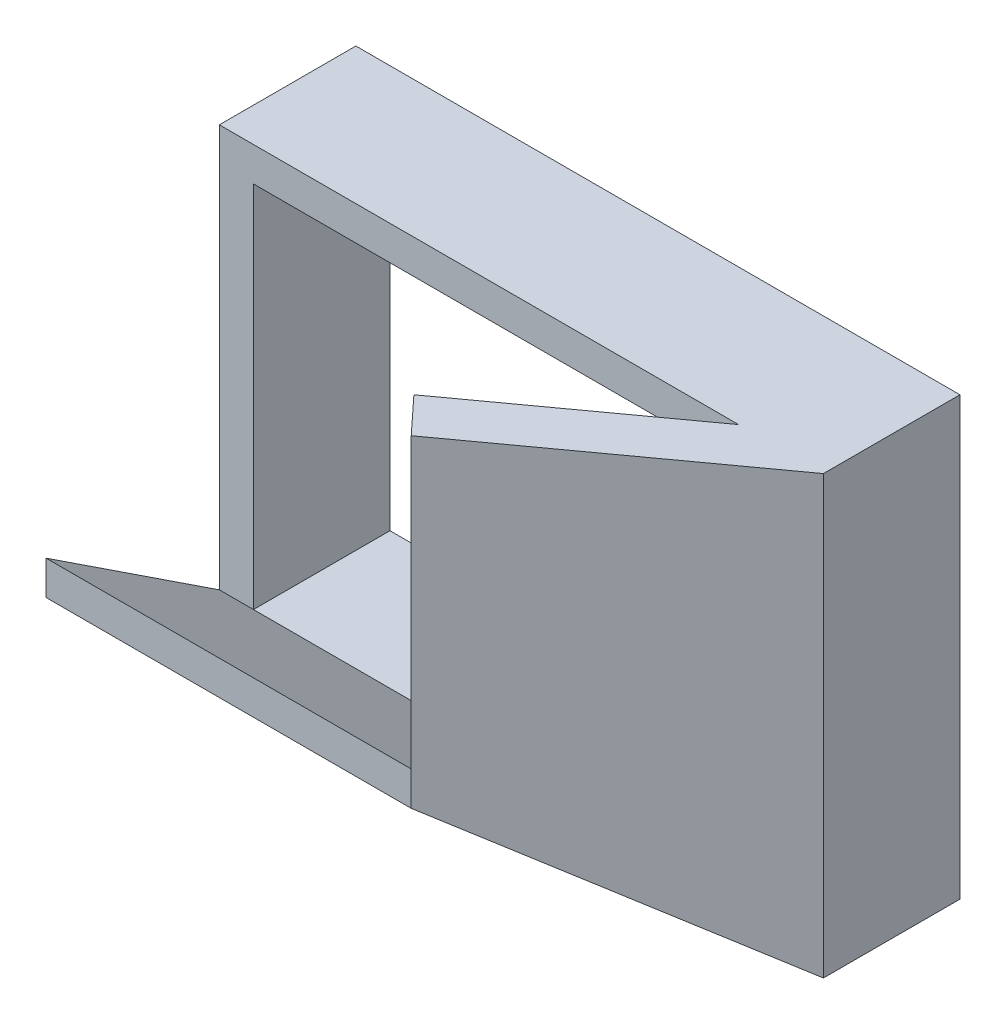
ISO-10303-21;
HEADER;
FILE_DESCRIPTION(('STEP AP214'),'2;1');
FILE_NAME('part.step','',(''),(''),'','','');
FILE_SCHEMA(('AUTOMOTIVE_DESIGN { 1 0 10303 214 1 1 1 1 }'));
ENDSEC;
DATA;
#1=APPLICATION_CONTEXT('core data for automotive mechanical design processes');
#2=APPLICATION_PROTOCOL_DEFINITION('international standard','automotive_design',2000,#1);
#3=PRODUCT_CONTEXT('',#1,'mechanical');
#4=PRODUCT('Part','Part','',(#3));
#5=PRODUCT_RELATED_PRODUCT_CATEGORY('part','',(#4));
#6=PRODUCT_DEFINITION_FORMATION('','',#4);
#7=PRODUCT_DEFINITION_CONTEXT('part definition',#1,'design');
#8=PRODUCT_DEFINITION('design','',#6,#7);
#9=PRODUCT_DEFINITION_SHAPE('','',#8);
#10=(LENGTH_UNIT() NAMED_UNIT(*) SI_UNIT(.MILLI.,.METRE.));
#11=(NAMED_UNIT(*) PLANE_ANGLE_UNIT() SI_UNIT($,.RADIAN.));
#12=(NAMED_UNIT(*) SI_UNIT($,.STERADIAN.) SOLID_ANGLE_UNIT());
#13=UNCERTAINTY_MEASURE_WITH_UNIT(LENGTH_MEASURE(1.E-05),#10,'distance_accuracy_value','');
#14=(GEOMETRIC_REPRESENTATION_CONTEXT(3) GLOBAL_UNCERTAINTY_ASSIGNED_CONTEXT((#13)) GLOBAL_UNIT_ASSIGNED_CONTEXT((#10,
#11,#12)) REPRESENTATION_CONTEXT('',''));
#15=CARTESIAN_POINT('',(0.,0.,0.));
#16=DIRECTION('',(0.,0.,1.));
#17=DIRECTION('',(1.,0.,0.));
#18=AXIS2_PLACEMENT_3D('',#15,#16,#17);
#19=CARTESIAN_POINT('',(-8.7,0.,-4.));
#20=DIRECTION('',(-1.,0.,0.));
#21=DIRECTION('',(0.,-1.,0.));
#22=AXIS2_PLACEMENT_3D('',#19,#20,#21);
#23=PLANE('',#22);
#24=DIRECTION('',(0.,-1.,0.));
#25=VECTOR('',#24,1.);
#26=CARTESIAN_POINT('',(-8.7,0.,0.));
#27=LINE('',#26,#25);
#28=CARTESIAN_POINT('',(-8.7,-1.3,0.));
#29=VERTEX_POINT('',#28);
#30=CARTESIAN_POINT('',(-8.7,-14.1,0.));
#31=VERTEX_POINT('',#30);
#32=EDGE_CURVE('E189',#29,#31,#27,.T.);
#33=ORIENTED_EDGE('',*,*,#32,.T.);
#34=DIRECTION('',(0.,0.,1.));
#35=VECTOR('',#34,1.);
#36=CARTESIAN_POINT('',(-8.7,-14.1,-4.));
#37=LINE('',#36,#35);
#38=CARTESIAN_POINT('',(-8.7,-14.1,-4.));
#39=VERTEX_POINT('',#38);
#40=EDGE_CURVE('E239',#39,#31,#37,.T.);
#41=ORIENTED_EDGE('',*,*,#40,.F.);
#42=DIRECTION('',(0.,-1.,0.));
#43=VECTOR('',#42,1.);
#44=CARTESIAN_POINT('',(-8.7,0.,-4.));
#45=LINE('',#44,#43);
#46=CARTESIAN_POINT('',(-8.7,-1.3,-4.));
#47=VERTEX_POINT('',#46);
#48=EDGE_CURVE('E190',#47,#39,#45,.T.);
#49=ORIENTED_EDGE('',*,*,#48,.F.);
#50=DIRECTION('',(0.,0.,1.));
#51=VECTOR('',#50,1.);
#52=CARTESIAN_POINT('',(-8.7,-1.3,-4.));
#53=LINE('',#52,#51);
#54=EDGE_CURVE('E212',#47,#29,#53,.T.);
#55=ORIENTED_EDGE('',*,*,#54,.T.);
#56=EDGE_LOOP('',(#33,#41,#49,#55));
#57=FACE_BOUND('',#56,.T.);
#58=ADVANCED_FACE('F38',(#57),#23,.F.);
#59=CARTESIAN_POINT('',(-33.0817568366624,-10.7569201692949,5.07774871457878));
#60=DIRECTION('',(0.,0.,1.));
#61=DIRECTION('',(0.,-1.,0.));
#62=AXIS2_PLACEMENT_3D('',#59,#60,#61);
#63=PLANE('',#62);
#64=DIRECTION('',(1.,0.,0.));
#65=VECTOR('',#64,1.);
#66=CARTESIAN_POINT('',(-33.0817568366624,-10.7569201692949,5.07774871457878));
#67=LINE('',#66,#65);
#68=CARTESIAN_POINT('',(-26.4,-10.7569201692949,5.07774871457878));
#69=VERTEX_POINT('',#68);
#70=CARTESIAN_POINT('',(-15.7,-10.7569201692949,5.07774871457878));
#71=VERTEX_POINT('',#70);
#72=EDGE_CURVE('E143',#69,#71,#67,.T.);
#73=ORIENTED_EDGE('',*,*,#72,.T.);
#74=DIRECTION('',(0.,1.,0.));
#75=VECTOR('',#74,1.);
#76=CARTESIAN_POINT('',(-15.7,-10.7569201692949,5.07774871457878));
#77=LINE('',#76,#75);
#78=CARTESIAN_POINT('',(-15.7,-9.75692016929486,5.07774871457877));
#79=VERTEX_POINT('',#78);
#80=EDGE_CURVE('E136',#71,#79,#77,.T.);
#81=ORIENTED_EDGE('',*,*,#80,.T.);
#82=DIRECTION('',(1.,0.,0.));
#83=VECTOR('',#82,1.);
#84=CARTESIAN_POINT('',(-33.0817568366624,-9.75692016929487,5.07774871457877));
#85=LINE('',#84,#83);
#86=CARTESIAN_POINT('',(-26.4,-9.75692016929486,5.07774871457877));
#87=VERTEX_POINT('',#86);
#88=EDGE_CURVE('E141',#87,#79,#85,.T.);
#89=ORIENTED_EDGE('',*,*,#88,.F.);
#90=DIRECTION('',(0.,-1.,0.));
#91=VECTOR('',#90,1.);
#92=CARTESIAN_POINT('',(-26.4,-10.7569201692949,5.07774871457878));
#93=LINE('',#92,#91);
#94=EDGE_CURVE('E263',#87,#69,#93,.T.);
#95=ORIENTED_EDGE('',*,*,#94,.T.);
#96=EDGE_LOOP('',(#73,#81,#89,#95));
#97=FACE_BOUND('',#96,.T.);
#98=ADVANCED_FACE('F138',(#97),#63,.T.);
#99=CARTESIAN_POINT('',(-33.0817568366624,-14.1,0.));
#100=DIRECTION('',(0.,-0.835231566271334,0.549898382161589));
#101=DIRECTION('',(0.,-0.549898382161589,-0.835231566271335));
#102=AXIS2_PLACEMENT_3D('',#99,#100,#101);
#103=PLANE('',#102);
#104=DIRECTION('',(1.,0.,0.));
#105=VECTOR('',#104,1.);
#106=CARTESIAN_POINT('',(0.,-14.1,0.));
#107=LINE('',#106,#105);
#108=CARTESIAN_POINT('',(-26.4,-14.1,0.));
#109=VERTEX_POINT('',#108);
#110=EDGE_CURVE('E218',#109,#31,#107,.T.);
#111=ORIENTED_EDGE('',*,*,#110,.T.);
#112=DIRECTION('',(-0.755006268059496,0.360578032400807,0.547676015305431));
#113=VECTOR('',#112,1.);
#114=CARTESIAN_POINT('',(-15.8428845982767,-10.6886809380638,5.1813961553263));
#115=LINE('',#114,#113);
#116=EDGE_CURVE('E147',#31,#71,#115,.T.);
#117=ORIENTED_EDGE('',*,*,#116,.T.);
#118=ORIENTED_EDGE('',*,*,#72,.F.);
#119=DIRECTION('',(0.,-0.549898382161589,-0.835231566271335));
#120=VECTOR('',#119,1.);
#121=CARTESIAN_POINT('',(-26.4,-14.1,0.));
#122=LINE('',#121,#120);
#123=EDGE_CURVE('E265',#69,#109,#122,.T.);
#124=ORIENTED_EDGE('',*,*,#123,.T.);
#125=EDGE_LOOP('',(#111,#117,#118,#124));
#126=FACE_BOUND('',#125,.T.);
#127=ADVANCED_FACE('F271',(#126),#103,.T.);
#128=CARTESIAN_POINT('',(0.,0.,0.));
#129=DIRECTION('',(0.,0.,1.));
#130=DIRECTION('',(1.,0.,0.));
#131=AXIS2_PLACEMENT_3D('',#128,#129,#130);
#132=PLANE('',#131);
#133=DIRECTION('',(1.,0.,0.));
#134=VECTOR('',#133,1.);
#135=CARTESIAN_POINT('',(-33.0817568366624,-13.1,0.));
#136=LINE('',#135,#134);
#137=CARTESIAN_POINT('',(-26.4,-13.1,0.));
#138=VERTEX_POINT('',#137);
#139=CARTESIAN_POINT('',(-25.4,-13.1,0.));
#140=VERTEX_POINT('',#139);
#141=EDGE_CURVE('E171',#138,#140,#136,.T.);
#142=ORIENTED_EDGE('',*,*,#141,.T.);
#143=DIRECTION('',(0.,-1.,0.));
#144=VECTOR('',#143,1.);
#145=CARTESIAN_POINT('',(-25.4,0.,0.));
#146=LINE('',#145,#144);
#147=CARTESIAN_POINT('',(-25.4,-2.3,0.));
#148=VERTEX_POINT('',#147);
#149=EDGE_CURVE('E193',#148,#140,#146,.T.);
#150=ORIENTED_EDGE('',*,*,#149,.F.);
#151=DIRECTION('',(1.,0.,0.));
#152=VECTOR('',#151,1.);
#153=CARTESIAN_POINT('',(0.,-2.3,0.));
#154=LINE('',#153,#152);
#155=CARTESIAN_POINT('',(-11.1857452438304,-2.29999999999999,0.));
#156=VERTEX_POINT('',#155);
#157=EDGE_CURVE('E221',#148,#156,#154,.T.);
#158=ORIENTED_EDGE('',*,*,#157,.T.);
#159=DIRECTION('',(0.,-1.,0.));
#160=VECTOR('',#159,1.);
#161=CARTESIAN_POINT('',(-11.1857452438304,0.,0.));
#162=LINE('',#161,#160);
#163=CARTESIAN_POINT('',(-11.1857452438304,-1.3,0.));
#164=VERTEX_POINT('',#163);
#165=EDGE_CURVE('E11',#164,#156,#162,.T.);
#166=ORIENTED_EDGE('',*,*,#165,.F.);
#167=DIRECTION('',(1.,0.,0.));
#168=VECTOR('',#167,1.);
#169=CARTESIAN_POINT('',(0.,-1.3,0.));
#170=LINE('',#169,#168);
#171=CARTESIAN_POINT('',(-26.4,-1.3,0.));
#172=VERTEX_POINT('',#171);
#173=EDGE_CURVE('E214',#172,#164,#170,.T.);
#174=ORIENTED_EDGE('',*,*,#173,.F.);
#175=DIRECTION('',(0.,-1.,0.));
#176=VECTOR('',#175,1.);
#177=CARTESIAN_POINT('',(-26.4,0.,0.));
#178=LINE('',#177,#176);
#179=EDGE_CURVE('E52',#172,#138,#178,.T.);
#180=ORIENTED_EDGE('',*,*,#179,.T.);
#181=EDGE_LOOP('',(#142,#150,#158,#166,#174,#180));
#182=FACE_BOUND('',#181,.T.);
#183=ADVANCED_FACE('F257',(#182),#132,.T.);
#184=CARTESIAN_POINT('',(0.,-2.3,-4.));
#185=DIRECTION('',(0.,-1.,0.));
#186=DIRECTION('',(0.,0.,-1.));
#187=AXIS2_PLACEMENT_3D('',#184,#185,#186);
#188=PLANE('',#187);
#189=DIRECTION('',(0.809459367929832,0.,-0.58717589500135));
#190=VECTOR('',#189,1.);
#191=CARTESIAN_POINT('',(-1.95539114824822,-2.3,-6.69563123484992));
#192=LINE('',#191,#190);
#193=CARTESIAN_POINT('',(-9.7,-2.29999999999999,-1.07774871457878));
#194=VERTEX_POINT('',#193);
#195=EDGE_CURVE('E187',#156,#194,#192,.T.);
#196=ORIENTED_EDGE('',*,*,#195,.F.);
#197=ORIENTED_EDGE('',*,*,#157,.F.);
#198=DIRECTION('',(0.,0.,1.));
#199=VECTOR('',#198,1.);
#200=CARTESIAN_POINT('',(-25.4,-2.3,-4.));
#201=LINE('',#200,#199);
#202=CARTESIAN_POINT('',(-25.4,-2.3,-4.));
#203=VERTEX_POINT('',#202);
#204=EDGE_CURVE('E45',#203,#148,#201,.T.);
#205=ORIENTED_EDGE('',*,*,#204,.F.);
#206=DIRECTION('',(1.,0.,0.));
#207=VECTOR('',#206,1.);
#208=CARTESIAN_POINT('',(0.,-2.3,-4.));
#209=LINE('',#208,#207);
#210=CARTESIAN_POINT('',(-9.7,-2.3,-4.));
#211=VERTEX_POINT('',#210);
#212=EDGE_CURVE('E201',#203,#211,#209,.T.);
#213=ORIENTED_EDGE('',*,*,#212,.T.);
#214=DIRECTION('',(0.,0.,1.));
#215=VECTOR('',#214,1.);
#216=CARTESIAN_POINT('',(-9.7,-2.3,-4.));
#217=LINE('',#216,#215);
#218=EDGE_CURVE('E236',#211,#194,#217,.T.);
#219=ORIENTED_EDGE('',*,*,#218,.T.);
#220=EDGE_LOOP('',(#196,#197,#205,#213,#219));
#221=FACE_BOUND('',#220,.T.);
#222=ADVANCED_FACE('F286',(#221),#188,.T.);
#223=CARTESIAN_POINT('',(-25.4,0.,-4.));
#224=DIRECTION('',(-1.,0.,0.));
#225=DIRECTION('',(0.,0.,1.));
#226=AXIS2_PLACEMENT_3D('',#223,#224,#225);
#227=PLANE('',#226);
#228=ORIENTED_EDGE('',*,*,#149,.T.);
#229=DIRECTION('',(0.,0.,1.));
#230=VECTOR('',#229,1.);
#231=CARTESIAN_POINT('',(-25.4,-13.1,-4.));
#232=LINE('',#231,#230);
#233=CARTESIAN_POINT('',(-25.4,-13.1,-4.));
#234=VERTEX_POINT('',#233);
#235=EDGE_CURVE('E230',#234,#140,#232,.T.);
#236=ORIENTED_EDGE('',*,*,#235,.F.);
#237=DIRECTION('',(0.,-1.,0.));
#238=VECTOR('',#237,1.);
#239=CARTESIAN_POINT('',(-25.4,0.,-4.));
#240=LINE('',#239,#238);
#241=EDGE_CURVE('E209',#203,#234,#240,.T.);
#242=ORIENTED_EDGE('',*,*,#241,.F.);
#243=ORIENTED_EDGE('',*,*,#204,.T.);
#244=EDGE_LOOP('',(#228,#236,#242,#243));
#245=FACE_BOUND('',#244,.T.);
#246=ADVANCED_FACE('F288',(#245),#227,.F.);
#247=CARTESIAN_POINT('',(0.,-13.1,-4.));
#248=DIRECTION('',(0.,-1.,0.));
#249=DIRECTION('',(0.,0.,-1.));
#250=AXIS2_PLACEMENT_3D('',#247,#248,#249);
#251=PLANE('',#250);
#252=DIRECTION('',(1.,0.,0.));
#253=VECTOR('',#252,1.);
#254=CARTESIAN_POINT('',(0.,-13.1,0.));
#255=LINE('',#254,#253);
#256=CARTESIAN_POINT('',(-11.1857452438304,-13.1,0.));
#257=VERTEX_POINT('',#256);
#258=EDGE_CURVE('E224',#140,#257,#255,.T.);
#259=ORIENTED_EDGE('',*,*,#258,.T.);
#260=DIRECTION('',(0.809459367929832,0.,-0.58717589500135));
#261=VECTOR('',#260,1.);
#262=CARTESIAN_POINT('',(-1.95539114824822,-13.1,-6.69563123484992));
#263=LINE('',#262,#261);
#264=CARTESIAN_POINT('',(-9.7,-13.1,-1.07774871457878));
#265=VERTEX_POINT('',#264);
#266=EDGE_CURVE('E182',#257,#265,#263,.T.);
#267=ORIENTED_EDGE('',*,*,#266,.T.);
#268=DIRECTION('',(0.,0.,1.));
#269=VECTOR('',#268,1.);
#270=CARTESIAN_POINT('',(-9.7,-13.1,-4.));
#271=LINE('',#270,#269);
#272=CARTESIAN_POINT('',(-9.7,-13.1,-4.));
#273=VERTEX_POINT('',#272);
#274=EDGE_CURVE('E233',#273,#265,#271,.T.);
#275=ORIENTED_EDGE('',*,*,#274,.F.);
#276=DIRECTION('',(1.,0.,0.));
#277=VECTOR('',#276,1.);
#278=CARTESIAN_POINT('',(0.,-13.1,-4.));
#279=LINE('',#278,#277);
#280=EDGE_CURVE('E207',#234,#273,#279,.T.);
#281=ORIENTED_EDGE('',*,*,#280,.F.);
#282=ORIENTED_EDGE('',*,*,#235,.T.);
#283=EDGE_LOOP('',(#259,#267,#275,#281,#282));
#284=FACE_BOUND('',#283,.T.);
#285=ADVANCED_FACE('F290',(#284),#251,.F.);
#286=CARTESIAN_POINT('',(0.,-14.1,-4.));
#287=DIRECTION('',(0.,-1.,0.));
#288=DIRECTION('',(0.,0.,-1.));
#289=AXIS2_PLACEMENT_3D('',#286,#287,#288);
#290=PLANE('',#289);
#291=ORIENTED_EDGE('',*,*,#40,.T.);
#292=ORIENTED_EDGE('',*,*,#110,.F.);
#293=DIRECTION('',(0.,0.,1.));
#294=VECTOR('',#293,1.);
#295=CARTESIAN_POINT('',(-26.4,-14.1,-4.));
#296=LINE('',#295,#294);
#297=CARTESIAN_POINT('',(-26.4,-14.1,-4.));
#298=VERTEX_POINT('',#297);
#299=EDGE_CURVE('E242',#298,#109,#296,.T.);
#300=ORIENTED_EDGE('',*,*,#299,.F.);
#301=DIRECTION('',(1.,0.,0.));
#302=VECTOR('',#301,1.);
#303=CARTESIAN_POINT('',(0.,-14.1,-4.));
#304=LINE('',#303,#302);
#305=EDGE_CURVE('E198',#298,#39,#304,.T.);
#306=ORIENTED_EDGE('',*,*,#305,.T.);
#307=EDGE_LOOP('',(#291,#292,#300,#306));
#308=FACE_BOUND('',#307,.T.);
#309=ADVANCED_FACE('F274',(#308),#290,.T.);
#310=CARTESIAN_POINT('',(-26.4,0.,-4.));
#311=DIRECTION('',(-1.,0.,0.));
#312=DIRECTION('',(0.,0.,1.));
#313=AXIS2_PLACEMENT_3D('',#310,#311,#312);
#314=PLANE('',#313);
#315=ORIENTED_EDGE('',*,*,#179,.F.);
#316=DIRECTION('',(0.,0.,1.));
#317=VECTOR('',#316,1.);
#318=CARTESIAN_POINT('',(-26.4,-1.3,-4.));
#319=LINE('',#318,#317);
#320=CARTESIAN_POINT('',(-26.4,-1.3,-4.));
#321=VERTEX_POINT('',#320);
#322=EDGE_CURVE('E244',#321,#172,#319,.T.);
#323=ORIENTED_EDGE('',*,*,#322,.F.);
#324=DIRECTION('',(0.,-1.,0.));
#325=VECTOR('',#324,1.);
#326=CARTESIAN_POINT('',(-26.4,0.,-4.));
#327=LINE('',#326,#325);
#328=EDGE_CURVE('E195',#321,#298,#327,.T.);
#329=ORIENTED_EDGE('',*,*,#328,.T.);
#330=ORIENTED_EDGE('',*,*,#299,.T.);
#331=ORIENTED_EDGE('',*,*,#123,.F.);
#332=ORIENTED_EDGE('',*,*,#94,.F.);
#333=DIRECTION('',(0.,0.54989838216159,0.835231566271334));
#334=VECTOR('',#333,1.);
#335=CARTESIAN_POINT('',(-26.4,-9.75692016929486,5.07774871457877));
#336=LINE('',#335,#334);
#337=EDGE_CURVE('E169',#138,#87,#336,.T.);
#338=ORIENTED_EDGE('',*,*,#337,.F.);
#339=EDGE_LOOP('',(#315,#323,#329,#330,#331,#332,#338));
#340=FACE_BOUND('',#339,.T.);
#341=ADVANCED_FACE('F261',(#340),#314,.T.);
#342=CARTESIAN_POINT('',(0.,-1.3,-4.));
#343=DIRECTION('',(0.,-1.,0.));
#344=DIRECTION('',(0.,0.,-1.));
#345=AXIS2_PLACEMENT_3D('',#342,#343,#344);
#346=PLANE('',#345);
#347=ORIENTED_EDGE('',*,*,#173,.T.);
#348=DIRECTION('',(-0.809459367929832,0.,0.58717589500135));
#349=VECTOR('',#348,1.);
#350=CARTESIAN_POINT('',(-3.85657126357393,-1.3,-5.31652910816737));
#351=LINE('',#350,#349);
#352=CARTESIAN_POINT('',(-16.7,-1.3,4.));
#353=VERTEX_POINT('',#352);
#354=EDGE_CURVE('E180',#164,#353,#351,.T.);
#355=ORIENTED_EDGE('',*,*,#354,.T.);
#356=DIRECTION('',(0.680171031560498,0.,0.733053454958046));
#357=VECTOR('',#356,1.);
#358=CARTESIAN_POINT('',(-10.9684419412842,-1.3,10.1771793303146));
#359=LINE('',#358,#357);
#360=CARTESIAN_POINT('',(-15.7,-1.3,5.07774871457878));
#361=VERTEX_POINT('',#360);
#362=EDGE_CURVE('E178',#353,#361,#359,.T.);
#363=ORIENTED_EDGE('',*,*,#362,.T.);
#364=DIRECTION('',(0.809459367929832,0.,-0.58717589500135));
#365=VECTOR('',#364,1.);
#366=CARTESIAN_POINT('',(-2.99954712553454,-1.3,-4.13506675083341));
#367=LINE('',#366,#365);
#368=EDGE_CURVE('E155',#361,#29,#367,.T.);
#369=ORIENTED_EDGE('',*,*,#368,.T.);
#370=ORIENTED_EDGE('',*,*,#54,.F.);
#371=DIRECTION('',(1.,0.,0.));
#372=VECTOR('',#371,1.);
#373=CARTESIAN_POINT('',(0.,-1.3,-4.));
#374=LINE('',#373,#372);
#375=EDGE_CURVE('E192',#321,#47,#374,.T.);
#376=ORIENTED_EDGE('',*,*,#375,.F.);
#377=ORIENTED_EDGE('',*,*,#322,.T.);
#378=EDGE_LOOP('',(#347,#355,#363,#369,#370,#376,#377));
#379=FACE_BOUND('',#378,.T.);
#380=ADVANCED_FACE('F252',(#379),#346,.F.);
#381=CARTESIAN_POINT('',(-9.7,0.,-4.));
#382=DIRECTION('',(-1.,0.,0.));
#383=DIRECTION('',(0.,0.,1.));
#384=AXIS2_PLACEMENT_3D('',#381,#382,#383);
#385=PLANE('',#384);
#386=DIRECTION('',(0.,-1.,0.));
#387=VECTOR('',#386,1.);
#388=CARTESIAN_POINT('',(-9.7,8.79406501863176,-1.07774871457878));
#389=LINE('',#388,#387);
#390=EDGE_CURVE('E159',#194,#265,#389,.T.);
#391=ORIENTED_EDGE('',*,*,#390,.F.);
#392=ORIENTED_EDGE('',*,*,#218,.F.);
#393=DIRECTION('',(0.,-1.,0.));
#394=VECTOR('',#393,1.);
#395=CARTESIAN_POINT('',(-9.7,0.,-4.));
#396=LINE('',#395,#394);
#397=EDGE_CURVE('E204',#211,#273,#396,.T.);
#398=ORIENTED_EDGE('',*,*,#397,.T.);
#399=ORIENTED_EDGE('',*,*,#274,.T.);
#400=EDGE_LOOP('',(#391,#392,#398,#399));
#401=FACE_BOUND('',#400,.T.);
#402=ADVANCED_FACE('F279',(#401),#385,.T.);
#403=CARTESIAN_POINT('',(0.,0.,-4.));
#404=DIRECTION('',(0.,0.,1.));
#405=DIRECTION('',(1.,0.,0.));
#406=AXIS2_PLACEMENT_3D('',#403,#404,#405);
#407=PLANE('',#406);
#408=ORIENTED_EDGE('',*,*,#48,.T.);
#409=ORIENTED_EDGE('',*,*,#305,.F.);
#410=ORIENTED_EDGE('',*,*,#328,.F.);
#411=ORIENTED_EDGE('',*,*,#375,.T.);
#412=EDGE_LOOP('',(#408,#409,#410,#411));
#413=FACE_BOUND('',#412,.T.);
#414=ORIENTED_EDGE('',*,*,#212,.F.);
#415=ORIENTED_EDGE('',*,*,#241,.T.);
#416=ORIENTED_EDGE('',*,*,#280,.T.);
#417=ORIENTED_EDGE('',*,*,#397,.F.);
#418=EDGE_LOOP('',(#414,#415,#416,#417));
#419=FACE_BOUND('',#418,.T.);
#420=ADVANCED_FACE('F276',(#413,#419),#407,.F.);
#421=CARTESIAN_POINT('',(-3.85657126357393,8.79406501863176,-5.31652910816737));
#422=DIRECTION('',(-0.58717589500135,0.,-0.809459367929832));
#423=DIRECTION('',(-0.809459367929832,0.,0.58717589500135));
#424=AXIS2_PLACEMENT_3D('',#421,#422,#423);
#425=PLANE('',#424);
#426=DIRECTION('',(0.755006268059495,-0.360578032400808,-0.547676015305432));
#427=VECTOR('',#426,1.);
#428=CARTESIAN_POINT('',(-10.7698961822699,-13.2986023729029,-0.301653862542502));
#429=LINE('',#428,#427);
#430=CARTESIAN_POINT('',(-16.7,-10.4664865918971,4.));
#431=VERTEX_POINT('',#430);
#432=EDGE_CURVE('E60',#431,#257,#429,.T.);
#433=ORIENTED_EDGE('',*,*,#432,.F.);
#434=DIRECTION('',(0.,-1.,0.));
#435=VECTOR('',#434,1.);
#436=CARTESIAN_POINT('',(-16.7,8.79406501863176,4.));
#437=LINE('',#436,#435);
#438=EDGE_CURVE('E158',#353,#431,#437,.T.);
#439=ORIENTED_EDGE('',*,*,#438,.F.);
#440=ORIENTED_EDGE('',*,*,#354,.F.);
#441=ORIENTED_EDGE('',*,*,#165,.T.);
#442=ORIENTED_EDGE('',*,*,#195,.T.);
#443=ORIENTED_EDGE('',*,*,#390,.T.);
#444=ORIENTED_EDGE('',*,*,#266,.F.);
#445=EDGE_LOOP('',(#433,#439,#440,#441,#442,#443,#444));
#446=FACE_BOUND('',#445,.T.);
#447=ADVANCED_FACE('F254',(#446),#425,.T.);
#448=CARTESIAN_POINT('',(-10.9684419412842,8.79406501863176,10.1771793303146));
#449=DIRECTION('',(-0.733053454958046,0.,0.680171031560498));
#450=DIRECTION('',(0.680171031560498,0.,0.733053454958046));
#451=AXIS2_PLACEMENT_3D('',#448,#449,#450);
#452=PLANE('',#451);
#453=DIRECTION('',(-0.612560811812333,-0.43465258386399,-0.660186627532073));
#454=VECTOR('',#453,1.);
#455=CARTESIAN_POINT('',(-6.92312051545784,-3.52914119183744,14.5370192970569));
#456=LINE('',#455,#454);
#457=EDGE_CURVE('E162',#79,#431,#456,.T.);
#458=ORIENTED_EDGE('',*,*,#457,.F.);
#459=DIRECTION('',(0.,-1.,0.));
#460=VECTOR('',#459,1.);
#461=CARTESIAN_POINT('',(-15.7,8.79406501863176,5.07774871457877));
#462=LINE('',#461,#460);
#463=EDGE_CURVE('E151',#361,#79,#462,.T.);
#464=ORIENTED_EDGE('',*,*,#463,.F.);
#465=ORIENTED_EDGE('',*,*,#362,.F.);
#466=ORIENTED_EDGE('',*,*,#438,.T.);
#467=EDGE_LOOP('',(#458,#464,#465,#466));
#468=FACE_BOUND('',#467,.T.);
#469=ADVANCED_FACE('F163',(#468),#452,.T.);
#470=CARTESIAN_POINT('',(-2.99954712553454,8.79406501863176,-4.13506675083341));
#471=DIRECTION('',(0.58717589500135,0.,0.809459367929832));
#472=DIRECTION('',(0.809459367929832,0.,-0.58717589500135));
#473=AXIS2_PLACEMENT_3D('',#470,#471,#472);
#474=PLANE('',#473);
#475=ORIENTED_EDGE('',*,*,#463,.T.);
#476=ORIENTED_EDGE('',*,*,#80,.F.);
#477=ORIENTED_EDGE('',*,*,#116,.F.);
#478=ORIENTED_EDGE('',*,*,#32,.F.);
#479=ORIENTED_EDGE('',*,*,#368,.F.);
#480=EDGE_LOOP('',(#475,#476,#477,#478,#479));
#481=FACE_BOUND('',#480,.T.);
#482=ADVANCED_FACE('F153',(#481),#474,.T.);
#483=CARTESIAN_POINT('',(-33.0817568366624,-9.75692016929487,5.07774871457877));
#484=DIRECTION('',(0.,0.835231566271334,-0.54989838216159));
#485=DIRECTION('',(0.,0.54989838216159,0.835231566271334));
#486=AXIS2_PLACEMENT_3D('',#483,#484,#485);
#487=PLANE('',#486);
#488=ORIENTED_EDGE('',*,*,#457,.T.);
#489=ORIENTED_EDGE('',*,*,#432,.T.);
#490=ORIENTED_EDGE('',*,*,#258,.F.);
#491=ORIENTED_EDGE('',*,*,#141,.F.);
#492=ORIENTED_EDGE('',*,*,#337,.T.);
#493=ORIENTED_EDGE('',*,*,#88,.T.);
#494=EDGE_LOOP('',(#488,#489,#490,#491,#492,#493));
#495=FACE_BOUND('',#494,.T.);
#496=ADVANCED_FACE('F167',(#495),#487,.T.);
#497=CLOSED_SHELL('',(#58,#98,#127,#183,#222,#246,#285,#309,#341,#380,#402,#420,#447,#469,#482,#496));
#498=MANIFOLD_SOLID_BREP('B2',#497);
#499=ADVANCED_BREP_SHAPE_REPRESENTATION('',(#18,#498),#14);
#500=SHAPE_DEFINITION_REPRESENTATION(#9,#499);
ENDSEC;
END-ISO-10303-21;
